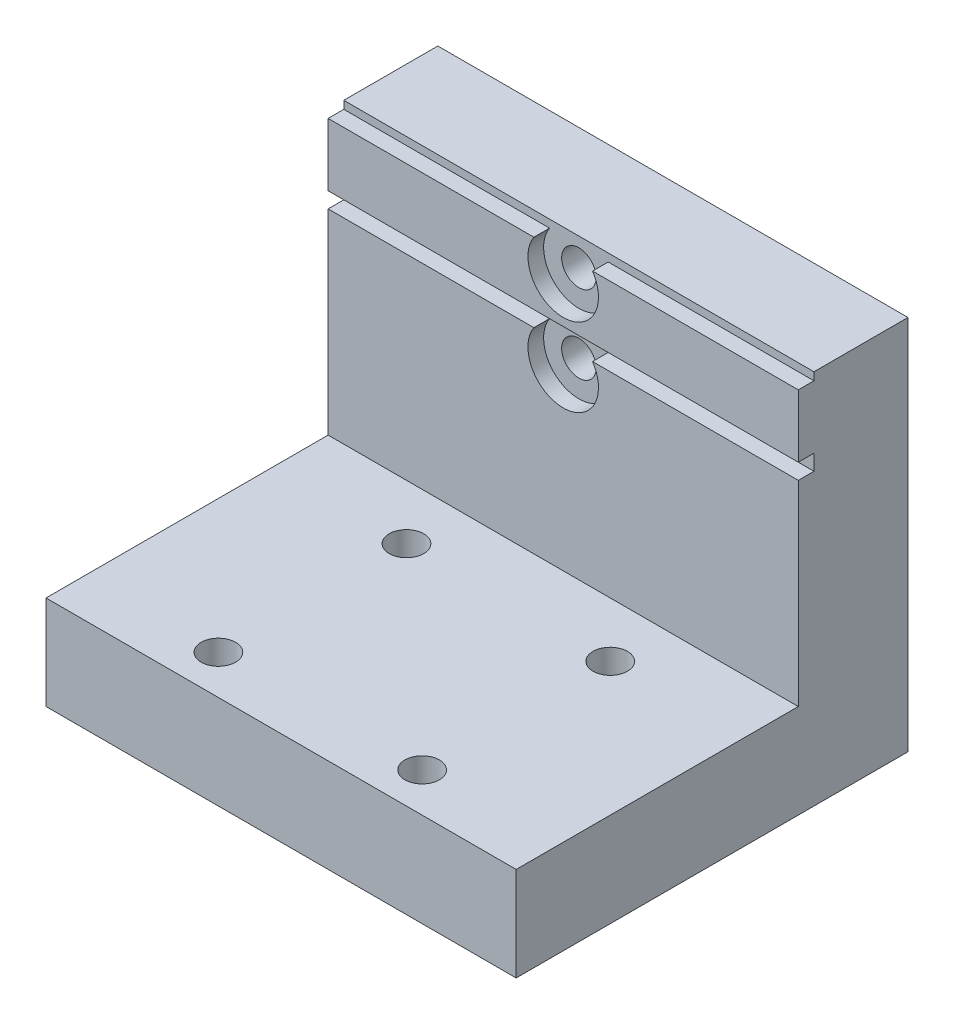
ISO-10303-21;
HEADER;
FILE_DESCRIPTION(('STEP AP214'),'2;1');
FILE_NAME('part.step','',(''),(''),'','','');
FILE_SCHEMA(('AUTOMOTIVE_DESIGN { 1 0 10303 214 1 1 1 1 }'));
ENDSEC;
DATA;
#1=APPLICATION_CONTEXT('core data for automotive mechanical design processes');
#2=APPLICATION_PROTOCOL_DEFINITION('international standard','automotive_design',2000,#1);
#3=PRODUCT_CONTEXT('',#1,'mechanical');
#4=PRODUCT('Part','Part','',(#3));
#5=PRODUCT_RELATED_PRODUCT_CATEGORY('part','',(#4));
#6=PRODUCT_DEFINITION_FORMATION('','',#4);
#7=PRODUCT_DEFINITION_CONTEXT('part definition',#1,'design');
#8=PRODUCT_DEFINITION('design','',#6,#7);
#9=PRODUCT_DEFINITION_SHAPE('','',#8);
#10=(LENGTH_UNIT() NAMED_UNIT(*) SI_UNIT(.MILLI.,.METRE.));
#11=(NAMED_UNIT(*) PLANE_ANGLE_UNIT() SI_UNIT($,.RADIAN.));
#12=(NAMED_UNIT(*) SI_UNIT($,.STERADIAN.) SOLID_ANGLE_UNIT());
#13=UNCERTAINTY_MEASURE_WITH_UNIT(LENGTH_MEASURE(1.E-05),#10,'distance_accuracy_value','');
#14=(GEOMETRIC_REPRESENTATION_CONTEXT(3) GLOBAL_UNCERTAINTY_ASSIGNED_CONTEXT((#13)) GLOBAL_UNIT_ASSIGNED_CONTEXT((#10,
#11,#12)) REPRESENTATION_CONTEXT('',''));
#15=CARTESIAN_POINT('',(0.,0.,0.));
#16=DIRECTION('',(0.,0.,1.));
#17=DIRECTION('',(1.,0.,0.));
#18=AXIS2_PLACEMENT_3D('',#15,#16,#17);
#19=CARTESIAN_POINT('',(-6.50000000000001,-48.,15.5));
#20=DIRECTION('',(0.,1.,0.));
#21=DIRECTION('',(0.,0.,1.));
#22=AXIS2_PLACEMENT_3D('',#19,#20,#21);
#23=CYLINDRICAL_SURFACE('',#22,1.1);
#24=CARTESIAN_POINT('',(-6.50000000000001,-18.,15.5));
#25=DIRECTION('',(0.,-1.,0.));
#26=DIRECTION('',(0.,0.,-1.));
#27=AXIS2_PLACEMENT_3D('',#24,#25,#26);
#28=CIRCLE('',#27,1.1);
#29=CARTESIAN_POINT('',(-6.50000000000001,-18.,14.4));
#30=VERTEX_POINT('',#29);
#31=EDGE_CURVE('E224',#30,#30,#28,.T.);
#32=ORIENTED_EDGE('',*,*,#31,.F.);
#33=EDGE_LOOP('',(#32));
#34=FACE_BOUND('',#33,.T.);
#35=CARTESIAN_POINT('',(-6.50000000000001,-22.,15.5));
#36=DIRECTION('',(0.,-1.,0.));
#37=DIRECTION('',(0.,0.,-1.));
#38=AXIS2_PLACEMENT_3D('',#35,#36,#37);
#39=CIRCLE('',#38,1.1);
#40=CARTESIAN_POINT('',(-6.50000000000001,-22.,14.4));
#41=VERTEX_POINT('',#40);
#42=EDGE_CURVE('E39',#41,#41,#39,.T.);
#43=ORIENTED_EDGE('',*,*,#42,.T.);
#44=EDGE_LOOP('',(#43));
#45=FACE_BOUND('',#44,.T.);
#46=ADVANCED_FACE('F35',(#34,#45),#23,.F.);
#47=CARTESIAN_POINT('',(6.5,-48.,15.5));
#48=DIRECTION('',(0.,1.,0.));
#49=DIRECTION('',(0.,0.,1.));
#50=AXIS2_PLACEMENT_3D('',#47,#48,#49);
#51=CYLINDRICAL_SURFACE('',#50,1.1);
#52=CARTESIAN_POINT('',(6.5,-18.,15.5));
#53=DIRECTION('',(0.,-1.,0.));
#54=DIRECTION('',(0.,0.,1.));
#55=AXIS2_PLACEMENT_3D('',#52,#53,#54);
#56=CIRCLE('',#55,1.1);
#57=CARTESIAN_POINT('',(6.5,-18.,16.6));
#58=VERTEX_POINT('',#57);
#59=EDGE_CURVE('E221',#58,#58,#56,.T.);
#60=ORIENTED_EDGE('',*,*,#59,.F.);
#61=EDGE_LOOP('',(#60));
#62=FACE_BOUND('',#61,.T.);
#63=CARTESIAN_POINT('',(6.5,-22.,15.5));
#64=DIRECTION('',(0.,-1.,0.));
#65=DIRECTION('',(0.,0.,-1.));
#66=AXIS2_PLACEMENT_3D('',#63,#64,#65);
#67=CIRCLE('',#66,1.1);
#68=CARTESIAN_POINT('',(6.5,-22.,14.4));
#69=VERTEX_POINT('',#68);
#70=EDGE_CURVE('E298',#69,#69,#67,.T.);
#71=ORIENTED_EDGE('',*,*,#70,.T.);
#72=EDGE_LOOP('',(#71));
#73=FACE_BOUND('',#72,.T.);
#74=ADVANCED_FACE('F408',(#62,#73),#51,.F.);
#75=CARTESIAN_POINT('',(6.5,-48.,3.49999999999999));
#76=DIRECTION('',(0.,1.,0.));
#77=DIRECTION('',(0.,0.,1.));
#78=AXIS2_PLACEMENT_3D('',#75,#76,#77);
#79=CYLINDRICAL_SURFACE('',#78,1.1);
#80=CARTESIAN_POINT('',(6.5,-18.,3.49999999999999));
#81=DIRECTION('',(0.,-1.,0.));
#82=DIRECTION('',(0.,0.,-1.));
#83=AXIS2_PLACEMENT_3D('',#80,#81,#82);
#84=CIRCLE('',#83,1.1);
#85=CARTESIAN_POINT('',(6.5,-18.,2.39999999999999));
#86=VERTEX_POINT('',#85);
#87=EDGE_CURVE('E225',#86,#86,#84,.T.);
#88=ORIENTED_EDGE('',*,*,#87,.F.);
#89=EDGE_LOOP('',(#88));
#90=FACE_BOUND('',#89,.T.);
#91=CARTESIAN_POINT('',(6.5,-22.,3.49999999999999));
#92=DIRECTION('',(0.,-1.,0.));
#93=DIRECTION('',(0.,0.,-1.));
#94=AXIS2_PLACEMENT_3D('',#91,#92,#93);
#95=CIRCLE('',#94,1.1);
#96=CARTESIAN_POINT('',(6.5,-22.,2.39999999999999));
#97=VERTEX_POINT('',#96);
#98=EDGE_CURVE('E295',#97,#97,#95,.T.);
#99=ORIENTED_EDGE('',*,*,#98,.T.);
#100=EDGE_LOOP('',(#99));
#101=FACE_BOUND('',#100,.T.);
#102=ADVANCED_FACE('F414',(#90,#101),#79,.F.);
#103=CARTESIAN_POINT('',(-6.50000000000001,-48.,3.49999999999999));
#104=DIRECTION('',(0.,1.,0.));
#105=DIRECTION('',(0.,0.,1.));
#106=AXIS2_PLACEMENT_3D('',#103,#104,#105);
#107=CYLINDRICAL_SURFACE('',#106,1.1);
#108=CARTESIAN_POINT('',(-6.50000000000001,-18.,3.49999999999999));
#109=DIRECTION('',(0.,-1.,0.));
#110=DIRECTION('',(0.,0.,1.));
#111=AXIS2_PLACEMENT_3D('',#108,#109,#110);
#112=CIRCLE('',#111,1.1);
#113=CARTESIAN_POINT('',(-6.50000000000001,-18.,4.59999999999999));
#114=VERTEX_POINT('',#113);
#115=EDGE_CURVE('E219',#114,#114,#112,.T.);
#116=ORIENTED_EDGE('',*,*,#115,.F.);
#117=EDGE_LOOP('',(#116));
#118=FACE_BOUND('',#117,.T.);
#119=CARTESIAN_POINT('',(-6.50000000000001,-22.,3.49999999999999));
#120=DIRECTION('',(0.,-1.,0.));
#121=DIRECTION('',(0.,0.,-1.));
#122=AXIS2_PLACEMENT_3D('',#119,#120,#121);
#123=CIRCLE('',#122,1.1);
#124=CARTESIAN_POINT('',(-6.50000000000001,-22.,2.39999999999999));
#125=VERTEX_POINT('',#124);
#126=EDGE_CURVE('E292',#125,#125,#123,.T.);
#127=ORIENTED_EDGE('',*,*,#126,.T.);
#128=EDGE_LOOP('',(#127));
#129=FACE_BOUND('',#128,.T.);
#130=ADVANCED_FACE('F419',(#118,#129),#107,.F.);
#131=CARTESIAN_POINT('',(15.,0.,-7.));
#132=DIRECTION('',(0.,-1.,0.));
#133=DIRECTION('',(0.,0.,-1.));
#134=AXIS2_PLACEMENT_3D('',#131,#132,#133);
#135=PLANE('',#134);
#136=DIRECTION('',(-1.,0.,0.));
#137=VECTOR('',#136,1.);
#138=CARTESIAN_POINT('',(15.,0.,-1.));
#139=LINE('',#138,#137);
#140=CARTESIAN_POINT('',(15.,0.,-1.));
#141=VERTEX_POINT('',#140);
#142=CARTESIAN_POINT('',(-15.,0.,-1.));
#143=VERTEX_POINT('',#142);
#144=EDGE_CURVE('E59',#141,#143,#139,.T.);
#145=ORIENTED_EDGE('',*,*,#144,.F.);
#146=DIRECTION('',(0.,0.,1.));
#147=VECTOR('',#146,1.);
#148=CARTESIAN_POINT('',(15.,0.,-7.));
#149=LINE('',#148,#147);
#150=CARTESIAN_POINT('',(15.,0.,-7.));
#151=VERTEX_POINT('',#150);
#152=EDGE_CURVE('E233',#151,#141,#149,.T.);
#153=ORIENTED_EDGE('',*,*,#152,.F.);
#154=DIRECTION('',(-1.,0.,0.));
#155=VECTOR('',#154,1.);
#156=CARTESIAN_POINT('',(15.,0.,-7.));
#157=LINE('',#156,#155);
#158=CARTESIAN_POINT('',(-15.,0.,-7.));
#159=VERTEX_POINT('',#158);
#160=EDGE_CURVE('E248',#151,#159,#157,.T.);
#161=ORIENTED_EDGE('',*,*,#160,.T.);
#162=DIRECTION('',(0.,0.,1.));
#163=VECTOR('',#162,1.);
#164=CARTESIAN_POINT('',(-15.,0.,-7.));
#165=LINE('',#164,#163);
#166=EDGE_CURVE('E232',#159,#143,#165,.T.);
#167=ORIENTED_EDGE('',*,*,#166,.T.);
#168=EDGE_LOOP('',(#145,#153,#161,#167));
#169=FACE_BOUND('',#168,.T.);
#170=ADVANCED_FACE('F37',(#169),#135,.F.);
#171=CARTESIAN_POINT('',(15.,0.,0.));
#172=DIRECTION('',(0.,0.,-1.));
#173=DIRECTION('',(0.,1.,0.));
#174=AXIS2_PLACEMENT_3D('',#171,#172,#173);
#175=PLANE('',#174);
#176=DIRECTION('',(0.,-1.,0.));
#177=VECTOR('',#176,1.);
#178=CARTESIAN_POINT('',(15.,0.,0.));
#179=LINE('',#178,#177);
#180=CARTESIAN_POINT('',(15.,-5.5,0.));
#181=VERTEX_POINT('',#180);
#182=CARTESIAN_POINT('',(15.,-18.,0.));
#183=VERTEX_POINT('',#182);
#184=EDGE_CURVE('E236',#181,#183,#179,.T.);
#185=ORIENTED_EDGE('',*,*,#184,.F.);
#186=DIRECTION('',(1.,0.,0.));
#187=VECTOR('',#186,1.);
#188=CARTESIAN_POINT('',(15.,-5.5,0.));
#189=LINE('',#188,#187);
#190=CARTESIAN_POINT('',(1.87082869338697,-5.5,0.));
#191=VERTEX_POINT('',#190);
#192=EDGE_CURVE('E181',#191,#181,#189,.T.);
#193=ORIENTED_EDGE('',*,*,#192,.F.);
#194=CARTESIAN_POINT('',(0.,-6.75,0.));
#195=DIRECTION('',(0.,0.,1.));
#196=DIRECTION('',(1.,0.,0.));
#197=AXIS2_PLACEMENT_3D('',#194,#195,#196);
#198=CIRCLE('',#197,2.25);
#199=CARTESIAN_POINT('',(-1.87082869338697,-5.5,0.));
#200=VERTEX_POINT('',#199);
#201=EDGE_CURVE('E202',#200,#191,#198,.T.);
#202=ORIENTED_EDGE('',*,*,#201,.F.);
#203=DIRECTION('',(1.,0.,0.));
#204=VECTOR('',#203,1.);
#205=CARTESIAN_POINT('',(-1.87082869338697,-5.5,0.));
#206=LINE('',#205,#204);
#207=CARTESIAN_POINT('',(-15.,-5.5,0.));
#208=VERTEX_POINT('',#207);
#209=EDGE_CURVE('E198',#208,#200,#206,.T.);
#210=ORIENTED_EDGE('',*,*,#209,.F.);
#211=DIRECTION('',(0.,-1.,0.));
#212=VECTOR('',#211,1.);
#213=CARTESIAN_POINT('',(-15.,0.,0.));
#214=LINE('',#213,#212);
#215=CARTESIAN_POINT('',(-15.,-18.,0.));
#216=VERTEX_POINT('',#215);
#217=EDGE_CURVE('E250',#208,#216,#214,.T.);
#218=ORIENTED_EDGE('',*,*,#217,.T.);
#219=DIRECTION('',(-1.,0.,0.));
#220=VECTOR('',#219,1.);
#221=CARTESIAN_POINT('',(15.,-18.,0.));
#222=LINE('',#221,#220);
#223=EDGE_CURVE('E44',#183,#216,#222,.T.);
#224=ORIENTED_EDGE('',*,*,#223,.F.);
#225=EDGE_LOOP('',(#185,#193,#202,#210,#218,#224));
#226=FACE_BOUND('',#225,.T.);
#227=ADVANCED_FACE('F387',(#226),#175,.F.);
#228=CARTESIAN_POINT('',(15.,-0.5,0.));
#229=VERTEX_POINT('',#228);
#230=CARTESIAN_POINT('',(15.,-4.5,0.));
#231=VERTEX_POINT('',#230);
#232=EDGE_CURVE('E239',#229,#231,#179,.T.);
#233=ORIENTED_EDGE('',*,*,#232,.F.);
#234=DIRECTION('',(1.,0.,0.));
#235=VECTOR('',#234,1.);
#236=CARTESIAN_POINT('',(15.,-0.5,0.));
#237=LINE('',#236,#235);
#238=CARTESIAN_POINT('',(1.87082869338697,-0.500000000000002,0.));
#239=VERTEX_POINT('',#238);
#240=EDGE_CURVE('E332',#239,#229,#237,.T.);
#241=ORIENTED_EDGE('',*,*,#240,.F.);
#242=CARTESIAN_POINT('',(0.,-1.75,0.));
#243=DIRECTION('',(0.,0.,1.));
#244=DIRECTION('',(1.,0.,0.));
#245=AXIS2_PLACEMENT_3D('',#242,#243,#244);
#246=CIRCLE('',#245,2.25);
#247=CARTESIAN_POINT('',(-1.87082869338697,-0.500000000000002,0.));
#248=VERTEX_POINT('',#247);
#249=EDGE_CURVE('E336',#248,#239,#246,.T.);
#250=ORIENTED_EDGE('',*,*,#249,.F.);
#251=DIRECTION('',(1.,0.,0.));
#252=VECTOR('',#251,1.);
#253=CARTESIAN_POINT('',(-1.87082869338697,-0.500000000000002,0.));
#254=LINE('',#253,#252);
#255=CARTESIAN_POINT('',(-15.,-0.500000000000004,0.));
#256=VERTEX_POINT('',#255);
#257=EDGE_CURVE('E209',#256,#248,#254,.T.);
#258=ORIENTED_EDGE('',*,*,#257,.F.);
#259=CARTESIAN_POINT('',(-15.,-4.5,0.));
#260=VERTEX_POINT('',#259);
#261=EDGE_CURVE('E168',#256,#260,#214,.T.);
#262=ORIENTED_EDGE('',*,*,#261,.T.);
#263=DIRECTION('',(-1.,0.,0.));
#264=VECTOR('',#263,1.);
#265=CARTESIAN_POINT('',(-1.87082869338697,-4.5,0.));
#266=LINE('',#265,#264);
#267=EDGE_CURVE('E196',#231,#260,#266,.T.);
#268=ORIENTED_EDGE('',*,*,#267,.F.);
#269=EDGE_LOOP('',(#233,#241,#250,#258,#262,#268));
#270=FACE_BOUND('',#269,.T.);
#271=ADVANCED_FACE('F350',(#270),#175,.F.);
#272=CARTESIAN_POINT('',(15.,-18.,0.));
#273=DIRECTION('',(0.,-1.,0.));
#274=DIRECTION('',(0.,0.,-1.));
#275=AXIS2_PLACEMENT_3D('',#272,#273,#274);
#276=PLANE('',#275);
#277=ORIENTED_EDGE('',*,*,#115,.T.);
#278=EDGE_LOOP('',(#277));
#279=FACE_BOUND('',#278,.T.);
#280=ORIENTED_EDGE('',*,*,#87,.T.);
#281=EDGE_LOOP('',(#280));
#282=FACE_BOUND('',#281,.T.);
#283=ORIENTED_EDGE('',*,*,#59,.T.);
#284=EDGE_LOOP('',(#283));
#285=FACE_BOUND('',#284,.T.);
#286=ORIENTED_EDGE('',*,*,#31,.T.);
#287=EDGE_LOOP('',(#286));
#288=FACE_BOUND('',#287,.T.);
#289=DIRECTION('',(0.,0.,1.));
#290=VECTOR('',#289,1.);
#291=CARTESIAN_POINT('',(-15.,-18.,0.));
#292=LINE('',#291,#290);
#293=CARTESIAN_POINT('',(-15.,-18.,18.));
#294=VERTEX_POINT('',#293);
#295=EDGE_CURVE('E252',#216,#294,#292,.T.);
#296=ORIENTED_EDGE('',*,*,#295,.T.);
#297=DIRECTION('',(-1.,0.,0.));
#298=VECTOR('',#297,1.);
#299=CARTESIAN_POINT('',(15.,-18.,18.));
#300=LINE('',#299,#298);
#301=CARTESIAN_POINT('',(15.,-18.,18.));
#302=VERTEX_POINT('',#301);
#303=EDGE_CURVE('E267',#302,#294,#300,.T.);
#304=ORIENTED_EDGE('',*,*,#303,.F.);
#305=DIRECTION('',(0.,0.,1.));
#306=VECTOR('',#305,1.);
#307=CARTESIAN_POINT('',(15.,-18.,0.));
#308=LINE('',#307,#306);
#309=EDGE_CURVE('E240',#183,#302,#308,.T.);
#310=ORIENTED_EDGE('',*,*,#309,.F.);
#311=ORIENTED_EDGE('',*,*,#223,.T.);
#312=EDGE_LOOP('',(#296,#304,#310,#311));
#313=FACE_BOUND('',#312,.T.);
#314=ADVANCED_FACE('F379',(#279,#282,#285,#288,#313),#276,.F.);
#315=CARTESIAN_POINT('',(15.,-18.,18.));
#316=DIRECTION('',(0.,0.,-1.));
#317=DIRECTION('',(-1.,0.,0.));
#318=AXIS2_PLACEMENT_3D('',#315,#316,#317);
#319=PLANE('',#318);
#320=DIRECTION('',(0.,-1.,0.));
#321=VECTOR('',#320,1.);
#322=CARTESIAN_POINT('',(-15.,-18.,18.));
#323=LINE('',#322,#321);
#324=CARTESIAN_POINT('',(-15.,-24.,18.));
#325=VERTEX_POINT('',#324);
#326=EDGE_CURVE('E254',#294,#325,#323,.T.);
#327=ORIENTED_EDGE('',*,*,#326,.T.);
#328=DIRECTION('',(-1.,0.,0.));
#329=VECTOR('',#328,1.);
#330=CARTESIAN_POINT('',(15.,-24.,18.));
#331=LINE('',#330,#329);
#332=CARTESIAN_POINT('',(15.,-24.,18.));
#333=VERTEX_POINT('',#332);
#334=EDGE_CURVE('E264',#333,#325,#331,.T.);
#335=ORIENTED_EDGE('',*,*,#334,.F.);
#336=DIRECTION('',(0.,-1.,0.));
#337=VECTOR('',#336,1.);
#338=CARTESIAN_POINT('',(15.,-18.,18.));
#339=LINE('',#338,#337);
#340=EDGE_CURVE('E242',#302,#333,#339,.T.);
#341=ORIENTED_EDGE('',*,*,#340,.F.);
#342=ORIENTED_EDGE('',*,*,#303,.T.);
#343=EDGE_LOOP('',(#327,#335,#341,#342));
#344=FACE_BOUND('',#343,.T.);
#345=ADVANCED_FACE('F375',(#344),#319,.F.);
#346=CARTESIAN_POINT('',(15.,-24.,18.));
#347=DIRECTION('',(0.,1.,0.));
#348=DIRECTION('',(0.,0.,1.));
#349=AXIS2_PLACEMENT_3D('',#346,#347,#348);
#350=PLANE('',#349);
#351=CARTESIAN_POINT('',(-6.50000000000001,-24.,3.49999999999999));
#352=DIRECTION('',(0.,-1.,0.));
#353=DIRECTION('',(0.,0.,-1.));
#354=AXIS2_PLACEMENT_3D('',#351,#352,#353);
#355=CIRCLE('',#354,2.2);
#356=CARTESIAN_POINT('',(-6.50000000000001,-24.,1.29999999999999));
#357=VERTEX_POINT('',#356);
#358=EDGE_CURVE('E466',#357,#357,#355,.T.);
#359=ORIENTED_EDGE('',*,*,#358,.F.);
#360=EDGE_LOOP('',(#359));
#361=FACE_BOUND('',#360,.T.);
#362=CARTESIAN_POINT('',(6.5,-24.,3.49999999999999));
#363=DIRECTION('',(0.,-1.,0.));
#364=DIRECTION('',(0.,0.,-1.));
#365=AXIS2_PLACEMENT_3D('',#362,#363,#364);
#366=CIRCLE('',#365,2.2);
#367=CARTESIAN_POINT('',(6.5,-24.,1.29999999999999));
#368=VERTEX_POINT('',#367);
#369=EDGE_CURVE('E465',#368,#368,#366,.T.);
#370=ORIENTED_EDGE('',*,*,#369,.F.);
#371=EDGE_LOOP('',(#370));
#372=FACE_BOUND('',#371,.T.);
#373=CARTESIAN_POINT('',(6.5,-24.,15.5));
#374=DIRECTION('',(0.,-1.,0.));
#375=DIRECTION('',(0.,0.,-1.));
#376=AXIS2_PLACEMENT_3D('',#373,#374,#375);
#377=CIRCLE('',#376,2.2);
#378=CARTESIAN_POINT('',(6.5,-24.,13.3));
#379=VERTEX_POINT('',#378);
#380=EDGE_CURVE('E815',#379,#379,#377,.T.);
#381=ORIENTED_EDGE('',*,*,#380,.F.);
#382=EDGE_LOOP('',(#381));
#383=FACE_BOUND('',#382,.T.);
#384=CARTESIAN_POINT('',(-6.50000000000001,-24.,15.5));
#385=DIRECTION('',(0.,-1.,0.));
#386=DIRECTION('',(0.,0.,-1.));
#387=AXIS2_PLACEMENT_3D('',#384,#385,#386);
#388=CIRCLE('',#387,2.2);
#389=CARTESIAN_POINT('',(-6.50000000000001,-24.,13.3));
#390=VERTEX_POINT('',#389);
#391=EDGE_CURVE('E477',#390,#390,#388,.T.);
#392=ORIENTED_EDGE('',*,*,#391,.F.);
#393=EDGE_LOOP('',(#392));
#394=FACE_BOUND('',#393,.T.);
#395=DIRECTION('',(0.,0.,-1.));
#396=VECTOR('',#395,1.);
#397=CARTESIAN_POINT('',(-15.,-24.,18.));
#398=LINE('',#397,#396);
#399=CARTESIAN_POINT('',(-15.,-24.,-7.));
#400=VERTEX_POINT('',#399);
#401=EDGE_CURVE('E256',#325,#400,#398,.T.);
#402=ORIENTED_EDGE('',*,*,#401,.T.);
#403=DIRECTION('',(-1.,0.,0.));
#404=VECTOR('',#403,1.);
#405=CARTESIAN_POINT('',(15.,-24.,-7.));
#406=LINE('',#405,#404);
#407=CARTESIAN_POINT('',(15.,-24.,-7.));
#408=VERTEX_POINT('',#407);
#409=EDGE_CURVE('E261',#408,#400,#406,.T.);
#410=ORIENTED_EDGE('',*,*,#409,.F.);
#411=DIRECTION('',(0.,0.,-1.));
#412=VECTOR('',#411,1.);
#413=CARTESIAN_POINT('',(15.,-24.,18.));
#414=LINE('',#413,#412);
#415=EDGE_CURVE('E244',#333,#408,#414,.T.);
#416=ORIENTED_EDGE('',*,*,#415,.F.);
#417=ORIENTED_EDGE('',*,*,#334,.T.);
#418=EDGE_LOOP('',(#402,#410,#416,#417));
#419=FACE_BOUND('',#418,.T.);
#420=ADVANCED_FACE('F371',(#361,#372,#383,#394,#419),#350,.F.);
#421=CARTESIAN_POINT('',(15.,-24.,-7.));
#422=DIRECTION('',(0.,0.,1.));
#423=DIRECTION('',(1.,0.,0.));
#424=AXIS2_PLACEMENT_3D('',#421,#422,#423);
#425=PLANE('',#424);
#426=CARTESIAN_POINT('',(-12.5,-21.,-7.));
#427=DIRECTION('',(0.,0.,-1.));
#428=DIRECTION('',(0.,1.,0.));
#429=AXIS2_PLACEMENT_3D('',#426,#427,#428);
#430=CIRCLE('',#429,2.075);
#431=CARTESIAN_POINT('',(-12.5,-18.925,-7.));
#432=VERTEX_POINT('',#431);
#433=EDGE_CURVE('E312',#432,#432,#430,.T.);
#434=ORIENTED_EDGE('',*,*,#433,.F.);
#435=EDGE_LOOP('',(#434));
#436=FACE_BOUND('',#435,.T.);
#437=CARTESIAN_POINT('',(12.5,-21.,-7.));
#438=DIRECTION('',(0.,0.,-1.));
#439=DIRECTION('',(0.,-1.,0.));
#440=AXIS2_PLACEMENT_3D('',#437,#438,#439);
#441=CIRCLE('',#440,2.075);
#442=CARTESIAN_POINT('',(12.5,-23.075,-7.));
#443=VERTEX_POINT('',#442);
#444=EDGE_CURVE('E303',#443,#443,#441,.T.);
#445=ORIENTED_EDGE('',*,*,#444,.F.);
#446=EDGE_LOOP('',(#445));
#447=FACE_BOUND('',#446,.T.);
#448=CARTESIAN_POINT('',(0.,-1.75,-7.));
#449=DIRECTION('',(0.,0.,1.));
#450=DIRECTION('',(1.,0.,0.));
#451=AXIS2_PLACEMENT_3D('',#448,#449,#450);
#452=CIRCLE('',#451,1.6);
#453=CARTESIAN_POINT('',(1.6,-1.75,-7.));
#454=VERTEX_POINT('',#453);
#455=EDGE_CURVE('E322',#454,#454,#452,.T.);
#456=ORIENTED_EDGE('',*,*,#455,.T.);
#457=EDGE_LOOP('',(#456));
#458=FACE_BOUND('',#457,.T.);
#459=CARTESIAN_POINT('',(0.,-6.75,-7.));
#460=DIRECTION('',(0.,0.,1.));
#461=DIRECTION('',(1.,0.,0.));
#462=AXIS2_PLACEMENT_3D('',#459,#460,#461);
#463=CIRCLE('',#462,1.6);
#464=CARTESIAN_POINT('',(1.6,-6.75,-7.));
#465=VERTEX_POINT('',#464);
#466=EDGE_CURVE('E319',#465,#465,#463,.T.);
#467=ORIENTED_EDGE('',*,*,#466,.T.);
#468=EDGE_LOOP('',(#467));
#469=FACE_BOUND('',#468,.T.);
#470=DIRECTION('',(0.,1.,0.));
#471=VECTOR('',#470,1.);
#472=CARTESIAN_POINT('',(-15.,-24.,-7.));
#473=LINE('',#472,#471);
#474=EDGE_CURVE('E237',#400,#159,#473,.T.);
#475=ORIENTED_EDGE('',*,*,#474,.T.);
#476=ORIENTED_EDGE('',*,*,#160,.F.);
#477=DIRECTION('',(0.,1.,0.));
#478=VECTOR('',#477,1.);
#479=CARTESIAN_POINT('',(15.,-24.,-7.));
#480=LINE('',#479,#478);
#481=EDGE_CURVE('E246',#408,#151,#480,.T.);
#482=ORIENTED_EDGE('',*,*,#481,.F.);
#483=ORIENTED_EDGE('',*,*,#409,.T.);
#484=EDGE_LOOP('',(#475,#476,#482,#483));
#485=FACE_BOUND('',#484,.T.);
#486=ADVANCED_FACE('F365',(#436,#447,#458,#469,#485),#425,.F.);
#487=CARTESIAN_POINT('',(15.,0.,0.));
#488=DIRECTION('',(1.,0.,0.));
#489=DIRECTION('',(0.,0.,-1.));
#490=AXIS2_PLACEMENT_3D('',#487,#488,#489);
#491=PLANE('',#490);
#492=DIRECTION('',(0.,0.,1.));
#493=VECTOR('',#492,1.);
#494=CARTESIAN_POINT('',(15.,-0.5,-1.));
#495=LINE('',#494,#493);
#496=CARTESIAN_POINT('',(15.,-0.5,-1.));
#497=VERTEX_POINT('',#496);
#498=EDGE_CURVE('E220',#497,#229,#495,.T.);
#499=ORIENTED_EDGE('',*,*,#498,.T.);
#500=ORIENTED_EDGE('',*,*,#232,.T.);
#501=DIRECTION('',(0.,0.,1.));
#502=VECTOR('',#501,1.);
#503=CARTESIAN_POINT('',(15.,-4.5,-1.));
#504=LINE('',#503,#502);
#505=CARTESIAN_POINT('',(15.,-4.5,-1.));
#506=VERTEX_POINT('',#505);
#507=EDGE_CURVE('E195',#506,#231,#504,.T.);
#508=ORIENTED_EDGE('',*,*,#507,.F.);
#509=DIRECTION('',(0.,1.,0.));
#510=VECTOR('',#509,1.);
#511=CARTESIAN_POINT('',(15.,-5.5,-1.));
#512=LINE('',#511,#510);
#513=CARTESIAN_POINT('',(15.,-5.5,-1.));
#514=VERTEX_POINT('',#513);
#515=EDGE_CURVE('E177',#514,#506,#512,.T.);
#516=ORIENTED_EDGE('',*,*,#515,.F.);
#517=DIRECTION('',(0.,0.,1.));
#518=VECTOR('',#517,1.);
#519=CARTESIAN_POINT('',(15.,-5.5,-1.));
#520=LINE('',#519,#518);
#521=EDGE_CURVE('E206',#514,#181,#520,.T.);
#522=ORIENTED_EDGE('',*,*,#521,.T.);
#523=ORIENTED_EDGE('',*,*,#184,.T.);
#524=ORIENTED_EDGE('',*,*,#309,.T.);
#525=ORIENTED_EDGE('',*,*,#340,.T.);
#526=ORIENTED_EDGE('',*,*,#415,.T.);
#527=ORIENTED_EDGE('',*,*,#481,.T.);
#528=ORIENTED_EDGE('',*,*,#152,.T.);
#529=DIRECTION('',(0.,1.,0.));
#530=VECTOR('',#529,1.);
#531=CARTESIAN_POINT('',(15.,-0.5,-1.));
#532=LINE('',#531,#530);
#533=EDGE_CURVE('E163',#497,#141,#532,.T.);
#534=ORIENTED_EDGE('',*,*,#533,.F.);
#535=EDGE_LOOP('',(#499,#500,#508,#516,#522,#523,#524,#525,#526,#527,#528,#534));
#536=FACE_BOUND('',#535,.T.);
#537=ADVANCED_FACE('F355',(#536),#491,.T.);
#538=CARTESIAN_POINT('',(-15.,0.,0.));
#539=DIRECTION('',(1.,0.,0.));
#540=DIRECTION('',(0.,0.,-1.));
#541=AXIS2_PLACEMENT_3D('',#538,#539,#540);
#542=PLANE('',#541);
#543=ORIENTED_EDGE('',*,*,#261,.F.);
#544=DIRECTION('',(0.,0.,1.));
#545=VECTOR('',#544,1.);
#546=CARTESIAN_POINT('',(-15.,-0.500000000000004,-1.));
#547=LINE('',#546,#545);
#548=CARTESIAN_POINT('',(-15.,-0.500000000000004,-1.));
#549=VERTEX_POINT('',#548);
#550=EDGE_CURVE('E158',#549,#256,#547,.T.);
#551=ORIENTED_EDGE('',*,*,#550,.F.);
#552=DIRECTION('',(0.,-1.,0.));
#553=VECTOR('',#552,1.);
#554=CARTESIAN_POINT('',(-15.,0.,-1.));
#555=LINE('',#554,#553);
#556=EDGE_CURVE('E12',#143,#549,#555,.T.);
#557=ORIENTED_EDGE('',*,*,#556,.F.);
#558=ORIENTED_EDGE('',*,*,#166,.F.);
#559=ORIENTED_EDGE('',*,*,#474,.F.);
#560=ORIENTED_EDGE('',*,*,#401,.F.);
#561=ORIENTED_EDGE('',*,*,#326,.F.);
#562=ORIENTED_EDGE('',*,*,#295,.F.);
#563=ORIENTED_EDGE('',*,*,#217,.F.);
#564=DIRECTION('',(0.,0.,1.));
#565=VECTOR('',#564,1.);
#566=CARTESIAN_POINT('',(-15.,-5.5,-1.));
#567=LINE('',#566,#565);
#568=CARTESIAN_POINT('',(-15.,-5.5,-1.));
#569=VERTEX_POINT('',#568);
#570=EDGE_CURVE('E214',#569,#208,#567,.T.);
#571=ORIENTED_EDGE('',*,*,#570,.F.);
#572=DIRECTION('',(0.,-1.,0.));
#573=VECTOR('',#572,1.);
#574=CARTESIAN_POINT('',(-15.,-5.5,-1.));
#575=LINE('',#574,#573);
#576=CARTESIAN_POINT('',(-15.,-4.5,-1.));
#577=VERTEX_POINT('',#576);
#578=EDGE_CURVE('E183',#577,#569,#575,.T.);
#579=ORIENTED_EDGE('',*,*,#578,.F.);
#580=DIRECTION('',(0.,0.,1.));
#581=VECTOR('',#580,1.);
#582=CARTESIAN_POINT('',(-15.,-4.5,-1.));
#583=LINE('',#582,#581);
#584=EDGE_CURVE('E52',#577,#260,#583,.T.);
#585=ORIENTED_EDGE('',*,*,#584,.T.);
#586=EDGE_LOOP('',(#543,#551,#557,#558,#559,#560,#561,#562,#563,#571,#579,#585));
#587=FACE_BOUND('',#586,.T.);
#588=ADVANCED_FACE('F166',(#587),#542,.F.);
#589=CARTESIAN_POINT('',(15.,-5.5,-1.));
#590=DIRECTION('',(0.,-1.,0.));
#591=DIRECTION('',(1.,0.,0.));
#592=AXIS2_PLACEMENT_3D('',#589,#590,#591);
#593=PLANE('',#592);
#594=ORIENTED_EDGE('',*,*,#192,.T.);
#595=ORIENTED_EDGE('',*,*,#521,.F.);
#596=DIRECTION('',(1.,0.,0.));
#597=VECTOR('',#596,1.);
#598=CARTESIAN_POINT('',(15.,-5.5,-1.));
#599=LINE('',#598,#597);
#600=CARTESIAN_POINT('',(1.87082869338697,-5.5,-1.));
#601=VERTEX_POINT('',#600);
#602=EDGE_CURVE('E192',#601,#514,#599,.T.);
#603=ORIENTED_EDGE('',*,*,#602,.F.);
#604=DIRECTION('',(0.,0.,1.));
#605=VECTOR('',#604,1.);
#606=CARTESIAN_POINT('',(1.87082869338697,-5.5,-1.));
#607=LINE('',#606,#605);
#608=EDGE_CURVE('E210',#601,#191,#607,.T.);
#609=ORIENTED_EDGE('',*,*,#608,.T.);
#610=EDGE_LOOP('',(#594,#595,#603,#609));
#611=FACE_BOUND('',#610,.T.);
#612=ADVANCED_FACE('F425',(#611),#593,.F.);
#613=CARTESIAN_POINT('',(0.,-6.75,-1.));
#614=DIRECTION('',(0.,0.,1.));
#615=DIRECTION('',(1.,0.,0.));
#616=AXIS2_PLACEMENT_3D('',#613,#614,#615);
#617=CYLINDRICAL_SURFACE('',#616,2.25);
#618=ORIENTED_EDGE('',*,*,#201,.T.);
#619=ORIENTED_EDGE('',*,*,#608,.F.);
#620=CARTESIAN_POINT('',(0.,-6.75,-1.));
#621=DIRECTION('',(0.,0.,1.));
#622=DIRECTION('',(1.,0.,0.));
#623=AXIS2_PLACEMENT_3D('',#620,#621,#622);
#624=CIRCLE('',#623,2.25);
#625=CARTESIAN_POINT('',(-1.87082869338697,-5.5,-1.));
#626=VERTEX_POINT('',#625);
#627=EDGE_CURVE('E189',#626,#601,#624,.T.);
#628=ORIENTED_EDGE('',*,*,#627,.F.);
#629=DIRECTION('',(0.,0.,1.));
#630=VECTOR('',#629,1.);
#631=CARTESIAN_POINT('',(-1.87082869338697,-5.5,-1.));
#632=LINE('',#631,#630);
#633=EDGE_CURVE('E212',#626,#200,#632,.T.);
#634=ORIENTED_EDGE('',*,*,#633,.T.);
#635=EDGE_LOOP('',(#618,#619,#628,#634));
#636=FACE_BOUND('',#635,.T.);
#637=ADVANCED_FACE('F404',(#636),#617,.F.);
#638=CARTESIAN_POINT('',(-1.87082869338697,-5.5,-1.));
#639=DIRECTION('',(0.,-1.,0.));
#640=DIRECTION('',(0.,0.,-1.));
#641=AXIS2_PLACEMENT_3D('',#638,#639,#640);
#642=PLANE('',#641);
#643=ORIENTED_EDGE('',*,*,#209,.T.);
#644=ORIENTED_EDGE('',*,*,#633,.F.);
#645=DIRECTION('',(1.,0.,0.));
#646=VECTOR('',#645,1.);
#647=CARTESIAN_POINT('',(-1.87082869338697,-5.5,-1.));
#648=LINE('',#647,#646);
#649=EDGE_CURVE('E186',#569,#626,#648,.T.);
#650=ORIENTED_EDGE('',*,*,#649,.F.);
#651=ORIENTED_EDGE('',*,*,#570,.T.);
#652=EDGE_LOOP('',(#643,#644,#650,#651));
#653=FACE_BOUND('',#652,.T.);
#654=ADVANCED_FACE('F391',(#653),#642,.F.);
#655=CARTESIAN_POINT('',(-1.87082869338697,-4.5,-1.));
#656=DIRECTION('',(0.,1.,0.));
#657=DIRECTION('',(0.,0.,1.));
#658=AXIS2_PLACEMENT_3D('',#655,#656,#657);
#659=PLANE('',#658);
#660=ORIENTED_EDGE('',*,*,#267,.T.);
#661=ORIENTED_EDGE('',*,*,#584,.F.);
#662=DIRECTION('',(-1.,0.,0.));
#663=VECTOR('',#662,1.);
#664=CARTESIAN_POINT('',(15.,-4.5,-1.));
#665=LINE('',#664,#663);
#666=EDGE_CURVE('E180',#506,#577,#665,.T.);
#667=ORIENTED_EDGE('',*,*,#666,.F.);
#668=ORIENTED_EDGE('',*,*,#507,.T.);
#669=EDGE_LOOP('',(#660,#661,#667,#668));
#670=FACE_BOUND('',#669,.T.);
#671=ADVANCED_FACE('F395',(#670),#659,.F.);
#672=CARTESIAN_POINT('',(0.,-6.75,-1.));
#673=DIRECTION('',(0.,0.,1.));
#674=DIRECTION('',(1.,0.,0.));
#675=AXIS2_PLACEMENT_3D('',#672,#673,#674);
#676=PLANE('',#675);
#677=CARTESIAN_POINT('',(0.,-6.75,-1.));
#678=DIRECTION('',(0.,0.,1.));
#679=DIRECTION('',(1.,0.,0.));
#680=AXIS2_PLACEMENT_3D('',#677,#678,#679);
#681=CIRCLE('',#680,1.1);
#682=CARTESIAN_POINT('',(1.1,-6.75,-1.));
#683=VERTEX_POINT('',#682);
#684=EDGE_CURVE('E199',#683,#683,#681,.T.);
#685=ORIENTED_EDGE('',*,*,#684,.F.);
#686=EDGE_LOOP('',(#685));
#687=FACE_BOUND('',#686,.T.);
#688=ORIENTED_EDGE('',*,*,#515,.T.);
#689=ORIENTED_EDGE('',*,*,#666,.T.);
#690=ORIENTED_EDGE('',*,*,#578,.T.);
#691=ORIENTED_EDGE('',*,*,#649,.T.);
#692=ORIENTED_EDGE('',*,*,#627,.T.);
#693=ORIENTED_EDGE('',*,*,#602,.T.);
#694=EDGE_LOOP('',(#688,#689,#690,#691,#692,#693));
#695=FACE_BOUND('',#694,.T.);
#696=ADVANCED_FACE('F394',(#687,#695),#676,.T.);
#697=CARTESIAN_POINT('',(0.,-1.75,-1.));
#698=DIRECTION('',(0.,0.,1.));
#699=DIRECTION('',(1.,0.,0.));
#700=AXIS2_PLACEMENT_3D('',#697,#698,#699);
#701=PLANE('',#700);
#702=CARTESIAN_POINT('',(0.,-1.75,-1.));
#703=DIRECTION('',(0.,0.,1.));
#704=DIRECTION('',(1.,0.,0.));
#705=AXIS2_PLACEMENT_3D('',#702,#703,#704);
#706=CIRCLE('',#705,1.1);
#707=CARTESIAN_POINT('',(1.1,-1.75,-1.));
#708=VERTEX_POINT('',#707);
#709=EDGE_CURVE('E272',#708,#708,#706,.T.);
#710=ORIENTED_EDGE('',*,*,#709,.F.);
#711=EDGE_LOOP('',(#710));
#712=FACE_BOUND('',#711,.T.);
#713=ORIENTED_EDGE('',*,*,#144,.T.);
#714=ORIENTED_EDGE('',*,*,#556,.T.);
#715=DIRECTION('',(1.,0.,0.));
#716=VECTOR('',#715,1.);
#717=CARTESIAN_POINT('',(-1.87082869338697,-0.500000000000002,-1.));
#718=LINE('',#717,#716);
#719=CARTESIAN_POINT('',(-1.87082869338697,-0.500000000000002,-1.));
#720=VERTEX_POINT('',#719);
#721=EDGE_CURVE('E150',#549,#720,#718,.T.);
#722=ORIENTED_EDGE('',*,*,#721,.T.);
#723=CARTESIAN_POINT('',(0.,-1.75,-1.));
#724=DIRECTION('',(0.,0.,1.));
#725=DIRECTION('',(1.,0.,0.));
#726=AXIS2_PLACEMENT_3D('',#723,#724,#725);
#727=CIRCLE('',#726,2.25);
#728=CARTESIAN_POINT('',(1.87082869338697,-0.500000000000002,-1.));
#729=VERTEX_POINT('',#728);
#730=EDGE_CURVE('E162',#720,#729,#727,.T.);
#731=ORIENTED_EDGE('',*,*,#730,.T.);
#732=DIRECTION('',(1.,0.,0.));
#733=VECTOR('',#732,1.);
#734=CARTESIAN_POINT('',(15.,-0.5,-1.));
#735=LINE('',#734,#733);
#736=EDGE_CURVE('E169',#729,#497,#735,.T.);
#737=ORIENTED_EDGE('',*,*,#736,.T.);
#738=ORIENTED_EDGE('',*,*,#533,.T.);
#739=EDGE_LOOP('',(#713,#714,#722,#731,#737,#738));
#740=FACE_BOUND('',#739,.T.);
#741=ADVANCED_FACE('F148',(#712,#740),#701,.T.);
#742=CARTESIAN_POINT('',(15.,-0.5,-1.));
#743=DIRECTION('',(0.,-1.,0.));
#744=DIRECTION('',(1.,0.,0.));
#745=AXIS2_PLACEMENT_3D('',#742,#743,#744);
#746=PLANE('',#745);
#747=ORIENTED_EDGE('',*,*,#240,.T.);
#748=ORIENTED_EDGE('',*,*,#498,.F.);
#749=ORIENTED_EDGE('',*,*,#736,.F.);
#750=DIRECTION('',(0.,0.,1.));
#751=VECTOR('',#750,1.);
#752=CARTESIAN_POINT('',(1.87082869338697,-0.500000000000002,-1.));
#753=LINE('',#752,#751);
#754=EDGE_CURVE('E171',#729,#239,#753,.T.);
#755=ORIENTED_EDGE('',*,*,#754,.T.);
#756=EDGE_LOOP('',(#747,#748,#749,#755));
#757=FACE_BOUND('',#756,.T.);
#758=ADVANCED_FACE('F343',(#757),#746,.F.);
#759=CARTESIAN_POINT('',(0.,-1.75,-1.));
#760=DIRECTION('',(0.,0.,1.));
#761=DIRECTION('',(1.,0.,0.));
#762=AXIS2_PLACEMENT_3D('',#759,#760,#761);
#763=CYLINDRICAL_SURFACE('',#762,2.25);
#764=ORIENTED_EDGE('',*,*,#249,.T.);
#765=ORIENTED_EDGE('',*,*,#754,.F.);
#766=ORIENTED_EDGE('',*,*,#730,.F.);
#767=DIRECTION('',(0.,0.,1.));
#768=VECTOR('',#767,1.);
#769=CARTESIAN_POINT('',(-1.87082869338697,-0.500000000000002,-1.));
#770=LINE('',#769,#768);
#771=EDGE_CURVE('E160',#720,#248,#770,.T.);
#772=ORIENTED_EDGE('',*,*,#771,.T.);
#773=EDGE_LOOP('',(#764,#765,#766,#772));
#774=FACE_BOUND('',#773,.T.);
#775=ADVANCED_FACE('F347',(#774),#763,.F.);
#776=CARTESIAN_POINT('',(-1.87082869338697,-0.500000000000002,-1.));
#777=DIRECTION('',(0.,-1.,0.));
#778=DIRECTION('',(1.,0.,0.));
#779=AXIS2_PLACEMENT_3D('',#776,#777,#778);
#780=PLANE('',#779);
#781=ORIENTED_EDGE('',*,*,#257,.T.);
#782=ORIENTED_EDGE('',*,*,#771,.F.);
#783=ORIENTED_EDGE('',*,*,#721,.F.);
#784=ORIENTED_EDGE('',*,*,#550,.T.);
#785=EDGE_LOOP('',(#781,#782,#783,#784));
#786=FACE_BOUND('',#785,.T.);
#787=ADVANCED_FACE('F157',(#786),#780,.F.);
#788=CARTESIAN_POINT('',(0.,-1.75,-10.1112698372208));
#789=DIRECTION('',(0.,0.,1.));
#790=DIRECTION('',(1.,0.,0.));
#791=AXIS2_PLACEMENT_3D('',#788,#789,#790);
#792=CYLINDRICAL_SURFACE('',#791,1.1);
#793=CARTESIAN_POINT('',(0.,-1.75,-4.));
#794=DIRECTION('',(0.,0.,1.));
#795=DIRECTION('',(1.,0.,0.));
#796=AXIS2_PLACEMENT_3D('',#793,#794,#795);
#797=CIRCLE('',#796,1.1);
#798=CARTESIAN_POINT('',(1.1,-1.75,-4.));
#799=VERTEX_POINT('',#798);
#800=EDGE_CURVE('E275',#799,#799,#797,.F.);
#801=ORIENTED_EDGE('',*,*,#800,.T.);
#802=EDGE_LOOP('',(#801));
#803=FACE_BOUND('',#802,.T.);
#804=ORIENTED_EDGE('',*,*,#709,.T.);
#805=EDGE_LOOP('',(#804));
#806=FACE_BOUND('',#805,.T.);
#807=ADVANCED_FACE('F508',(#803,#806),#792,.F.);
#808=CARTESIAN_POINT('',(0.,-6.75,-10.1112698372208));
#809=DIRECTION('',(0.,0.,1.));
#810=DIRECTION('',(1.,0.,0.));
#811=AXIS2_PLACEMENT_3D('',#808,#809,#810);
#812=CYLINDRICAL_SURFACE('',#811,1.1);
#813=CARTESIAN_POINT('',(0.,-6.75,-4.));
#814=DIRECTION('',(0.,0.,1.));
#815=DIRECTION('',(1.,0.,0.));
#816=AXIS2_PLACEMENT_3D('',#813,#814,#815);
#817=CIRCLE('',#816,1.1);
#818=CARTESIAN_POINT('',(1.1,-6.75,-4.));
#819=VERTEX_POINT('',#818);
#820=EDGE_CURVE('E278',#819,#819,#817,.F.);
#821=ORIENTED_EDGE('',*,*,#820,.T.);
#822=EDGE_LOOP('',(#821));
#823=FACE_BOUND('',#822,.T.);
#824=ORIENTED_EDGE('',*,*,#684,.T.);
#825=EDGE_LOOP('',(#824));
#826=FACE_BOUND('',#825,.T.);
#827=ADVANCED_FACE('F502',(#823,#826),#812,.F.);
#828=CARTESIAN_POINT('',(15.,-24.,-4.));
#829=DIRECTION('',(0.,0.,1.));
#830=DIRECTION('',(1.,0.,0.));
#831=AXIS2_PLACEMENT_3D('',#828,#829,#830);
#832=PLANE('',#831);
#833=CARTESIAN_POINT('',(0.,-6.75,-4.));
#834=DIRECTION('',(0.,0.,1.));
#835=DIRECTION('',(1.,0.,0.));
#836=AXIS2_PLACEMENT_3D('',#833,#834,#835);
#837=CIRCLE('',#836,1.6);
#838=CARTESIAN_POINT('',(1.6,-6.75,-4.));
#839=VERTEX_POINT('',#838);
#840=EDGE_CURVE('E325',#839,#839,#837,.T.);
#841=ORIENTED_EDGE('',*,*,#840,.F.);
#842=EDGE_LOOP('',(#841));
#843=FACE_BOUND('',#842,.T.);
#844=ORIENTED_EDGE('',*,*,#820,.F.);
#845=EDGE_LOOP('',(#844));
#846=FACE_BOUND('',#845,.T.);
#847=ADVANCED_FACE('F496',(#843,#846),#832,.F.);
#848=CARTESIAN_POINT('',(0.,-6.75,3.52548339959391));
#849=DIRECTION('',(0.,0.,-1.));
#850=DIRECTION('',(0.,1.,0.));
#851=AXIS2_PLACEMENT_3D('',#848,#849,#850);
#852=CYLINDRICAL_SURFACE('',#851,1.6);
#853=ORIENTED_EDGE('',*,*,#466,.F.);
#854=EDGE_LOOP('',(#853));
#855=FACE_BOUND('',#854,.T.);
#856=ORIENTED_EDGE('',*,*,#840,.T.);
#857=EDGE_LOOP('',(#856));
#858=FACE_BOUND('',#857,.T.);
#859=ADVANCED_FACE('F492',(#855,#858),#852,.F.);
#860=CARTESIAN_POINT('',(15.,-24.,-4.));
#861=DIRECTION('',(0.,0.,1.));
#862=DIRECTION('',(1.,0.,0.));
#863=AXIS2_PLACEMENT_3D('',#860,#861,#862);
#864=PLANE('',#863);
#865=CARTESIAN_POINT('',(0.,-1.75,-4.));
#866=DIRECTION('',(0.,0.,1.));
#867=DIRECTION('',(1.,0.,0.));
#868=AXIS2_PLACEMENT_3D('',#865,#866,#867);
#869=CIRCLE('',#868,1.6);
#870=CARTESIAN_POINT('',(1.6,-1.75,-4.));
#871=VERTEX_POINT('',#870);
#872=EDGE_CURVE('E281',#871,#871,#869,.T.);
#873=ORIENTED_EDGE('',*,*,#872,.F.);
#874=EDGE_LOOP('',(#873));
#875=FACE_BOUND('',#874,.T.);
#876=ORIENTED_EDGE('',*,*,#800,.F.);
#877=EDGE_LOOP('',(#876));
#878=FACE_BOUND('',#877,.T.);
#879=ADVANCED_FACE('F495',(#875,#878),#864,.F.);
#880=CARTESIAN_POINT('',(0.,-1.75,3.52548339959391));
#881=DIRECTION('',(0.,0.,-1.));
#882=DIRECTION('',(0.,1.,0.));
#883=AXIS2_PLACEMENT_3D('',#880,#881,#882);
#884=CYLINDRICAL_SURFACE('',#883,1.6);
#885=ORIENTED_EDGE('',*,*,#455,.F.);
#886=EDGE_LOOP('',(#885));
#887=FACE_BOUND('',#886,.T.);
#888=ORIENTED_EDGE('',*,*,#872,.T.);
#889=EDGE_LOOP('',(#888));
#890=FACE_BOUND('',#889,.T.);
#891=ADVANCED_FACE('F607',(#887,#890),#884,.F.);
#892=CARTESIAN_POINT('',(-12.5,-21.,-3.));
#893=DIRECTION('',(0.,0.,-1.));
#894=DIRECTION('',(0.,1.,0.));
#895=AXIS2_PLACEMENT_3D('',#892,#893,#894);
#896=PLANE('',#895);
#897=CARTESIAN_POINT('',(-12.5,-21.,-3.));
#898=DIRECTION('',(0.,0.,-1.));
#899=DIRECTION('',(0.,1.,0.));
#900=AXIS2_PLACEMENT_3D('',#897,#898,#899);
#901=CIRCLE('',#900,2.075);
#902=CARTESIAN_POINT('',(-12.5,-18.925,-3.));
#903=VERTEX_POINT('',#902);
#904=EDGE_CURVE('E288',#903,#903,#901,.T.);
#905=ORIENTED_EDGE('',*,*,#904,.T.);
#906=EDGE_LOOP('',(#905));
#907=FACE_BOUND('',#906,.T.);
#908=CARTESIAN_POINT('',(-12.5,-21.,-3.));
#909=DIRECTION('',(0.,0.,-1.));
#910=DIRECTION('',(0.,1.,0.));
#911=AXIS2_PLACEMENT_3D('',#908,#909,#910);
#912=CIRCLE('',#911,1.6);
#913=CARTESIAN_POINT('',(-12.5,-19.4,-3.));
#914=VERTEX_POINT('',#913);
#915=EDGE_CURVE('E284',#914,#914,#912,.F.);
#916=ORIENTED_EDGE('',*,*,#915,.T.);
#917=EDGE_LOOP('',(#916));
#918=FACE_BOUND('',#917,.T.);
#919=ADVANCED_FACE('F617',(#907,#918),#896,.T.);
#920=CARTESIAN_POINT('',(-12.5,-21.,-3.));
#921=DIRECTION('',(0.,0.,-1.));
#922=DIRECTION('',(0.,1.,0.));
#923=AXIS2_PLACEMENT_3D('',#920,#921,#922);
#924=CYLINDRICAL_SURFACE('',#923,2.075);
#925=ORIENTED_EDGE('',*,*,#904,.F.);
#926=EDGE_LOOP('',(#925));
#927=FACE_BOUND('',#926,.T.);
#928=ORIENTED_EDGE('',*,*,#433,.T.);
#929=EDGE_LOOP('',(#928));
#930=FACE_BOUND('',#929,.T.);
#931=ADVANCED_FACE('F485',(#927,#930),#924,.F.);
#932=CARTESIAN_POINT('',(12.5,-21.,-3.));
#933=DIRECTION('',(0.,0.,1.));
#934=DIRECTION('',(0.,-1.,0.));
#935=AXIS2_PLACEMENT_3D('',#932,#933,#934);
#936=PLANE('',#935);
#937=CARTESIAN_POINT('',(12.5,-21.,-3.));
#938=DIRECTION('',(0.,0.,-1.));
#939=DIRECTION('',(0.,-1.,0.));
#940=AXIS2_PLACEMENT_3D('',#937,#938,#939);
#941=CIRCLE('',#940,2.075);
#942=CARTESIAN_POINT('',(12.5,-23.075,-3.));
#943=VERTEX_POINT('',#942);
#944=EDGE_CURVE('E307',#943,#943,#941,.T.);
#945=ORIENTED_EDGE('',*,*,#944,.T.);
#946=EDGE_LOOP('',(#945));
#947=FACE_BOUND('',#946,.T.);
#948=CARTESIAN_POINT('',(12.5,-21.,-3.));
#949=DIRECTION('',(0.,0.,1.));
#950=DIRECTION('',(0.,-1.,0.));
#951=AXIS2_PLACEMENT_3D('',#948,#949,#950);
#952=CIRCLE('',#951,1.6);
#953=CARTESIAN_POINT('',(12.5,-22.6,-3.));
#954=VERTEX_POINT('',#953);
#955=EDGE_CURVE('E287',#954,#954,#952,.F.);
#956=ORIENTED_EDGE('',*,*,#955,.F.);
#957=EDGE_LOOP('',(#956));
#958=FACE_BOUND('',#957,.T.);
#959=ADVANCED_FACE('F672',(#947,#958),#936,.F.);
#960=CARTESIAN_POINT('',(12.5,-21.,-3.));
#961=DIRECTION('',(0.,0.,-1.));
#962=DIRECTION('',(0.,1.,0.));
#963=AXIS2_PLACEMENT_3D('',#960,#961,#962);
#964=CYLINDRICAL_SURFACE('',#963,2.075);
#965=ORIENTED_EDGE('',*,*,#944,.F.);
#966=EDGE_LOOP('',(#965));
#967=FACE_BOUND('',#966,.T.);
#968=ORIENTED_EDGE('',*,*,#444,.T.);
#969=EDGE_LOOP('',(#968));
#970=FACE_BOUND('',#969,.T.);
#971=ADVANCED_FACE('F644',(#967,#970),#964,.F.);
#972=CARTESIAN_POINT('',(-12.5,-21.,8.));
#973=DIRECTION('',(0.,0.,-1.));
#974=DIRECTION('',(0.,1.,0.));
#975=AXIS2_PLACEMENT_3D('',#972,#973,#974);
#976=PLANE('',#975);
#977=CARTESIAN_POINT('',(-12.5,-21.,8.));
#978=DIRECTION('',(0.,0.,-1.));
#979=DIRECTION('',(0.,1.,0.));
#980=AXIS2_PLACEMENT_3D('',#977,#978,#979);
#981=CIRCLE('',#980,1.6);
#982=CARTESIAN_POINT('',(-12.5,-19.4,8.));
#983=VERTEX_POINT('',#982);
#984=EDGE_CURVE('E316',#983,#983,#981,.T.);
#985=ORIENTED_EDGE('',*,*,#984,.T.);
#986=EDGE_LOOP('',(#985));
#987=FACE_BOUND('',#986,.T.);
#988=ADVANCED_FACE('F640',(#987),#976,.T.);
#989=CARTESIAN_POINT('',(-12.5,-21.,8.));
#990=DIRECTION('',(0.,0.,-1.));
#991=DIRECTION('',(0.,1.,0.));
#992=AXIS2_PLACEMENT_3D('',#989,#990,#991);
#993=CYLINDRICAL_SURFACE('',#992,1.6);
#994=ORIENTED_EDGE('',*,*,#984,.F.);
#995=EDGE_LOOP('',(#994));
#996=FACE_BOUND('',#995,.T.);
#997=ORIENTED_EDGE('',*,*,#915,.F.);
#998=EDGE_LOOP('',(#997));
#999=FACE_BOUND('',#998,.T.);
#1000=ADVANCED_FACE('F631',(#996,#999),#993,.F.);
#1001=CARTESIAN_POINT('',(12.5,-21.,8.));
#1002=DIRECTION('',(0.,0.,1.));
#1003=DIRECTION('',(0.,-1.,0.));
#1004=AXIS2_PLACEMENT_3D('',#1001,#1002,#1003);
#1005=PLANE('',#1004);
#1006=CARTESIAN_POINT('',(12.5,-21.,8.));
#1007=DIRECTION('',(0.,0.,-1.));
#1008=DIRECTION('',(0.,-1.,0.));
#1009=AXIS2_PLACEMENT_3D('',#1006,#1007,#1008);
#1010=CIRCLE('',#1009,1.6);
#1011=CARTESIAN_POINT('',(12.5,-22.6,8.));
#1012=VERTEX_POINT('',#1011);
#1013=EDGE_CURVE('E291',#1012,#1012,#1010,.T.);
#1014=ORIENTED_EDGE('',*,*,#1013,.T.);
#1015=EDGE_LOOP('',(#1014));
#1016=FACE_BOUND('',#1015,.T.);
#1017=ADVANCED_FACE('F625',(#1016),#1005,.F.);
#1018=CARTESIAN_POINT('',(12.5,-21.,8.));
#1019=DIRECTION('',(0.,0.,-1.));
#1020=DIRECTION('',(0.,1.,0.));
#1021=AXIS2_PLACEMENT_3D('',#1018,#1019,#1020);
#1022=CYLINDRICAL_SURFACE('',#1021,1.6);
#1023=ORIENTED_EDGE('',*,*,#955,.T.);
#1024=EDGE_LOOP('',(#1023));
#1025=FACE_BOUND('',#1024,.T.);
#1026=ORIENTED_EDGE('',*,*,#1013,.F.);
#1027=EDGE_LOOP('',(#1026));
#1028=FACE_BOUND('',#1027,.T.);
#1029=ADVANCED_FACE('F630',(#1025,#1028),#1022,.F.);
#1030=CARTESIAN_POINT('',(-6.50000000000001,-22.,3.49999999999999));
#1031=DIRECTION('',(0.,-1.,0.));
#1032=DIRECTION('',(0.,0.,-1.));
#1033=AXIS2_PLACEMENT_3D('',#1030,#1031,#1032);
#1034=CYLINDRICAL_SURFACE('',#1033,2.2);
#1035=CARTESIAN_POINT('',(-6.50000000000001,-22.,3.49999999999999));
#1036=DIRECTION('',(0.,-1.,0.));
#1037=DIRECTION('',(0.,0.,-1.));
#1038=AXIS2_PLACEMENT_3D('',#1035,#1036,#1037);
#1039=CIRCLE('',#1038,2.2);
#1040=CARTESIAN_POINT('',(-6.50000000000001,-22.,1.29999999999999));
#1041=VERTEX_POINT('',#1040);
#1042=EDGE_CURVE('E463',#1041,#1041,#1039,.T.);
#1043=ORIENTED_EDGE('',*,*,#1042,.F.);
#1044=EDGE_LOOP('',(#1043));
#1045=FACE_BOUND('',#1044,.T.);
#1046=ORIENTED_EDGE('',*,*,#358,.T.);
#1047=EDGE_LOOP('',(#1046));
#1048=FACE_BOUND('',#1047,.T.);
#1049=ADVANCED_FACE('F459',(#1045,#1048),#1034,.F.);
#1050=CARTESIAN_POINT('',(-6.50000000000001,-22.,3.49999999999999));
#1051=DIRECTION('',(0.,-1.,0.));
#1052=DIRECTION('',(0.,0.,-1.));
#1053=AXIS2_PLACEMENT_3D('',#1050,#1051,#1052);
#1054=PLANE('',#1053);
#1055=ORIENTED_EDGE('',*,*,#126,.F.);
#1056=EDGE_LOOP('',(#1055));
#1057=FACE_BOUND('',#1056,.T.);
#1058=ORIENTED_EDGE('',*,*,#1042,.T.);
#1059=EDGE_LOOP('',(#1058));
#1060=FACE_BOUND('',#1059,.T.);
#1061=ADVANCED_FACE('F455',(#1057,#1060),#1054,.T.);
#1062=CARTESIAN_POINT('',(6.5,-22.,3.49999999999999));
#1063=DIRECTION('',(0.,-1.,0.));
#1064=DIRECTION('',(0.,0.,-1.));
#1065=AXIS2_PLACEMENT_3D('',#1062,#1063,#1064);
#1066=CYLINDRICAL_SURFACE('',#1065,2.2);
#1067=CARTESIAN_POINT('',(6.5,-22.,3.49999999999999));
#1068=DIRECTION('',(0.,-1.,0.));
#1069=DIRECTION('',(0.,0.,-1.));
#1070=AXIS2_PLACEMENT_3D('',#1067,#1068,#1069);
#1071=CIRCLE('',#1070,2.2);
#1072=CARTESIAN_POINT('',(6.5,-22.,1.29999999999999));
#1073=VERTEX_POINT('',#1072);
#1074=EDGE_CURVE('E469',#1073,#1073,#1071,.T.);
#1075=ORIENTED_EDGE('',*,*,#1074,.F.);
#1076=EDGE_LOOP('',(#1075));
#1077=FACE_BOUND('',#1076,.T.);
#1078=ORIENTED_EDGE('',*,*,#369,.T.);
#1079=EDGE_LOOP('',(#1078));
#1080=FACE_BOUND('',#1079,.T.);
#1081=ADVANCED_FACE('F458',(#1077,#1080),#1066,.F.);
#1082=CARTESIAN_POINT('',(6.5,-22.,3.49999999999999));
#1083=DIRECTION('',(0.,-1.,0.));
#1084=DIRECTION('',(0.,0.,-1.));
#1085=AXIS2_PLACEMENT_3D('',#1082,#1083,#1084);
#1086=PLANE('',#1085);
#1087=ORIENTED_EDGE('',*,*,#98,.F.);
#1088=EDGE_LOOP('',(#1087));
#1089=FACE_BOUND('',#1088,.T.);
#1090=ORIENTED_EDGE('',*,*,#1074,.T.);
#1091=EDGE_LOOP('',(#1090));
#1092=FACE_BOUND('',#1091,.T.);
#1093=ADVANCED_FACE('F753',(#1089,#1092),#1086,.T.);
#1094=CARTESIAN_POINT('',(6.5,-22.,15.5));
#1095=DIRECTION('',(0.,-1.,0.));
#1096=DIRECTION('',(0.,0.,-1.));
#1097=AXIS2_PLACEMENT_3D('',#1094,#1095,#1096);
#1098=CYLINDRICAL_SURFACE('',#1097,2.2);
#1099=CARTESIAN_POINT('',(6.5,-22.,15.5));
#1100=DIRECTION('',(0.,-1.,0.));
#1101=DIRECTION('',(0.,0.,-1.));
#1102=AXIS2_PLACEMENT_3D('',#1099,#1100,#1101);
#1103=CIRCLE('',#1102,2.2);
#1104=CARTESIAN_POINT('',(6.5,-22.,13.3));
#1105=VERTEX_POINT('',#1104);
#1106=EDGE_CURVE('E480',#1105,#1105,#1103,.T.);
#1107=ORIENTED_EDGE('',*,*,#1106,.F.);
#1108=EDGE_LOOP('',(#1107));
#1109=FACE_BOUND('',#1108,.T.);
#1110=ORIENTED_EDGE('',*,*,#380,.T.);
#1111=EDGE_LOOP('',(#1110));
#1112=FACE_BOUND('',#1111,.T.);
#1113=ADVANCED_FACE('F763',(#1109,#1112),#1098,.F.);
#1114=CARTESIAN_POINT('',(6.5,-22.,15.5));
#1115=DIRECTION('',(0.,-1.,0.));
#1116=DIRECTION('',(0.,0.,-1.));
#1117=AXIS2_PLACEMENT_3D('',#1114,#1115,#1116);
#1118=PLANE('',#1117);
#1119=ORIENTED_EDGE('',*,*,#70,.F.);
#1120=EDGE_LOOP('',(#1119));
#1121=FACE_BOUND('',#1120,.T.);
#1122=ORIENTED_EDGE('',*,*,#1106,.T.);
#1123=EDGE_LOOP('',(#1122));
#1124=FACE_BOUND('',#1123,.T.);
#1125=ADVANCED_FACE('F773',(#1121,#1124),#1118,.T.);
#1126=CARTESIAN_POINT('',(-6.50000000000001,-22.,15.5));
#1127=DIRECTION('',(0.,-1.,0.));
#1128=DIRECTION('',(0.,0.,-1.));
#1129=AXIS2_PLACEMENT_3D('',#1126,#1127,#1128);
#1130=CYLINDRICAL_SURFACE('',#1129,2.2);
#1131=CARTESIAN_POINT('',(-6.50000000000001,-22.,15.5));
#1132=DIRECTION('',(0.,-1.,0.));
#1133=DIRECTION('',(0.,0.,-1.));
#1134=AXIS2_PLACEMENT_3D('',#1131,#1132,#1133);
#1135=CIRCLE('',#1134,2.2);
#1136=CARTESIAN_POINT('',(-6.50000000000001,-22.,13.3));
#1137=VERTEX_POINT('',#1136);
#1138=EDGE_CURVE('E296',#1137,#1137,#1135,.T.);
#1139=ORIENTED_EDGE('',*,*,#1138,.F.);
#1140=EDGE_LOOP('',(#1139));
#1141=FACE_BOUND('',#1140,.T.);
#1142=ORIENTED_EDGE('',*,*,#391,.T.);
#1143=EDGE_LOOP('',(#1142));
#1144=FACE_BOUND('',#1143,.T.);
#1145=ADVANCED_FACE('F783',(#1141,#1144),#1130,.F.);
#1146=CARTESIAN_POINT('',(-6.50000000000001,-22.,15.5));
#1147=DIRECTION('',(0.,-1.,0.));
#1148=DIRECTION('',(0.,0.,-1.));
#1149=AXIS2_PLACEMENT_3D('',#1146,#1147,#1148);
#1150=PLANE('',#1149);
#1151=ORIENTED_EDGE('',*,*,#42,.F.);
#1152=EDGE_LOOP('',(#1151));
#1153=FACE_BOUND('',#1152,.T.);
#1154=ORIENTED_EDGE('',*,*,#1138,.T.);
#1155=EDGE_LOOP('',(#1154));
#1156=FACE_BOUND('',#1155,.T.);
#1157=ADVANCED_FACE('F793',(#1153,#1156),#1150,.T.);
#1158=CLOSED_SHELL('',(#46,#74,#102,#130,#170,#227,#271,#314,#345,#420,#486,#537,#588,#612,#637,
#654,#671,#696,#741,#758,#775,#787,#807,#827,#847,#859,#879,#891,#919,#931,#959,#971,#988,#1000,
#1017,#1029,#1049,#1061,#1081,#1093,#1113,#1125,#1145,#1157));
#1159=MANIFOLD_SOLID_BREP('B2',#1158);
#1160=ADVANCED_BREP_SHAPE_REPRESENTATION('',(#18,#1159),#14);
#1161=SHAPE_DEFINITION_REPRESENTATION(#9,#1160);
ENDSEC;
END-ISO-10303-21;
